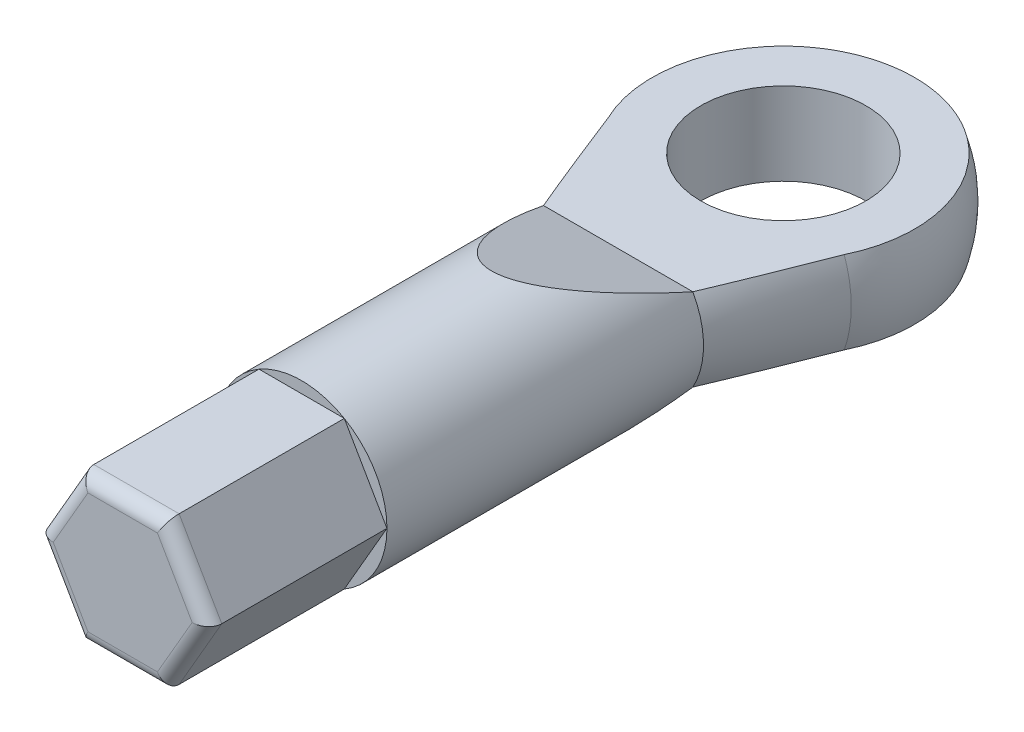
ISO-10303-21;
HEADER;
FILE_DESCRIPTION(('STEP AP214'),'2;1');
FILE_NAME('part.step','',(''),(''),'','','');
FILE_SCHEMA(('AUTOMOTIVE_DESIGN { 1 0 10303 214 1 1 1 1 }'));
ENDSEC;
DATA;
#1=APPLICATION_CONTEXT('core data for automotive mechanical design processes');
#2=APPLICATION_PROTOCOL_DEFINITION('international standard','automotive_design',2000,#1);
#3=PRODUCT_CONTEXT('',#1,'mechanical');
#4=PRODUCT('Part','Part','',(#3));
#5=PRODUCT_RELATED_PRODUCT_CATEGORY('part','',(#4));
#6=PRODUCT_DEFINITION_FORMATION('','',#4);
#7=PRODUCT_DEFINITION_CONTEXT('part definition',#1,'design');
#8=PRODUCT_DEFINITION('design','',#6,#7);
#9=PRODUCT_DEFINITION_SHAPE('','',#8);
#10=(LENGTH_UNIT() NAMED_UNIT(*) SI_UNIT(.MILLI.,.METRE.));
#11=(NAMED_UNIT(*) PLANE_ANGLE_UNIT() SI_UNIT($,.RADIAN.));
#12=(NAMED_UNIT(*) SI_UNIT($,.STERADIAN.) SOLID_ANGLE_UNIT());
#13=UNCERTAINTY_MEASURE_WITH_UNIT(LENGTH_MEASURE(1.E-05),#10,'distance_accuracy_value','');
#14=(GEOMETRIC_REPRESENTATION_CONTEXT(3) GLOBAL_UNCERTAINTY_ASSIGNED_CONTEXT((#13)) GLOBAL_UNIT_ASSIGNED_CONTEXT((#10,
#11,#12)) REPRESENTATION_CONTEXT('',''));
#15=CARTESIAN_POINT('',(0.,0.,0.));
#16=DIRECTION('',(0.,0.,1.));
#17=DIRECTION('',(1.,0.,0.));
#18=AXIS2_PLACEMENT_3D('',#15,#16,#17);
#19=CARTESIAN_POINT('',(0.,0.,-29.));
#20=DIRECTION('',(0.,0.,-1.));
#21=DIRECTION('',(-1.,0.,0.));
#22=AXIS2_PLACEMENT_3D('',#19,#20,#21);
#23=CYLINDRICAL_SURFACE('',#22,3.1);
#24=CARTESIAN_POINT('',(0.,0.,-22.3122593853305));
#25=DIRECTION('',(0.,0.944491108816165,-0.328536977168796));
#26=DIRECTION('',(0.,-0.328536977168796,-0.944491108816166));
#27=AXIS2_PLACEMENT_3D('',#24,#25,#26);
#28=ELLIPSE('',#27,9.43577196915427,3.1);
#29=CARTESIAN_POINT('',(-2.71293199325011,1.5,-18.));
#30=VERTEX_POINT('',#29);
#31=CARTESIAN_POINT('',(2.71293199325011,1.5,-18.));
#32=VERTEX_POINT('',#31);
#33=EDGE_CURVE('E268',#30,#32,#28,.T.);
#34=ORIENTED_EDGE('',*,*,#33,.F.);
#35=CARTESIAN_POINT('',(0.,0.,-18.));
#36=DIRECTION('',(0.,0.,-1.));
#37=DIRECTION('',(-1.,0.,0.));
#38=AXIS2_PLACEMENT_3D('',#35,#36,#37);
#39=CIRCLE('',#38,3.1);
#40=CARTESIAN_POINT('',(-2.71293199325011,-1.5,-18.));
#41=VERTEX_POINT('',#40);
#42=EDGE_CURVE('E272',#41,#30,#39,.T.);
#43=ORIENTED_EDGE('',*,*,#42,.F.);
#44=CARTESIAN_POINT('',(0.,0.,-22.3122593853305));
#45=DIRECTION('',(0.,0.944491108816165,0.328536977168796));
#46=DIRECTION('',(0.,0.328536977168796,-0.944491108816166));
#47=AXIS2_PLACEMENT_3D('',#44,#45,#46);
#48=ELLIPSE('',#47,9.43577196915426,3.1);
#49=CARTESIAN_POINT('',(2.71293199325011,-1.5,-18.));
#50=VERTEX_POINT('',#49);
#51=EDGE_CURVE('E278',#41,#50,#48,.T.);
#52=ORIENTED_EDGE('',*,*,#51,.T.);
#53=EDGE_CURVE('E273',#32,#50,#39,.T.);
#54=ORIENTED_EDGE('',*,*,#53,.F.);
#55=EDGE_LOOP('',(#34,#43,#52,#54));
#56=FACE_BOUND('',#55,.T.);
#57=CARTESIAN_POINT('',(0.,0.,-6.5));
#58=DIRECTION('',(0.,0.,1.));
#59=DIRECTION('',(1.,0.,0.));
#60=AXIS2_PLACEMENT_3D('',#57,#58,#59);
#61=CIRCLE('',#60,3.1);
#62=CARTESIAN_POINT('',(1.55,2.68467875173176,-6.5));
#63=VERTEX_POINT('',#62);
#64=CARTESIAN_POINT('',(-1.55,2.68467875173176,-6.5));
#65=VERTEX_POINT('',#64);
#66=EDGE_CURVE('E168',#63,#65,#61,.T.);
#67=ORIENTED_EDGE('',*,*,#66,.F.);
#68=CARTESIAN_POINT('',(3.1,0.,-6.5));
#69=VERTEX_POINT('',#68);
#70=EDGE_CURVE('E159',#69,#63,#61,.T.);
#71=ORIENTED_EDGE('',*,*,#70,.F.);
#72=CARTESIAN_POINT('',(1.55,-2.68467875173176,-6.5));
#73=VERTEX_POINT('',#72);
#74=EDGE_CURVE('E169',#73,#69,#61,.T.);
#75=ORIENTED_EDGE('',*,*,#74,.F.);
#76=CARTESIAN_POINT('',(-1.55,-2.68467875173176,-6.5));
#77=VERTEX_POINT('',#76);
#78=EDGE_CURVE('E210',#77,#73,#61,.T.);
#79=ORIENTED_EDGE('',*,*,#78,.F.);
#80=CARTESIAN_POINT('',(-3.1,0.,-6.5));
#81=VERTEX_POINT('',#80);
#82=EDGE_CURVE('E204',#81,#77,#61,.T.);
#83=ORIENTED_EDGE('',*,*,#82,.F.);
#84=EDGE_CURVE('E196',#65,#81,#61,.T.);
#85=ORIENTED_EDGE('',*,*,#84,.F.);
#86=EDGE_LOOP('',(#67,#71,#75,#79,#83,#85));
#87=FACE_BOUND('',#86,.T.);
#88=ADVANCED_FACE('F60',(#56,#87),#23,.T.);
#89=CARTESIAN_POINT('',(0.,0.,-24.));
#90=DIRECTION('',(0.,0.,-1.));
#91=DIRECTION('',(1.,0.,0.));
#92=AXIS2_PLACEMENT_3D('',#89,#90,#91);
#93=SPHERICAL_SURFACE('',#92,5.);
#94=CARTESIAN_POINT('',(0.,0.,-21.9195474114293));
#95=DIRECTION('',(0.,0.,-1.));
#96=DIRECTION('',(-1.,0.,0.));
#97=AXIS2_PLACEMENT_3D('',#94,#95,#96);
#98=CIRCLE('',#97,4.54661599727858);
#99=CARTESIAN_POINT('',(-4.29205277538726,-1.5,-21.9195474114293));
#100=VERTEX_POINT('',#99);
#101=CARTESIAN_POINT('',(-4.29205277538726,1.5,-21.9195474114293));
#102=VERTEX_POINT('',#101);
#103=EDGE_CURVE('E296',#100,#102,#98,.T.);
#104=ORIENTED_EDGE('',*,*,#103,.T.);
#105=CARTESIAN_POINT('',(0.,1.5,-24.));
#106=DIRECTION('',(0.,1.,0.));
#107=DIRECTION('',(0.,0.,1.));
#108=AXIS2_PLACEMENT_3D('',#105,#106,#107);
#109=CIRCLE('',#108,4.76969600708473);
#110=CARTESIAN_POINT('',(4.29205277538726,1.5,-21.9195474114293));
#111=VERTEX_POINT('',#110);
#112=EDGE_CURVE('E282',#102,#111,#109,.F.);
#113=ORIENTED_EDGE('',*,*,#112,.T.);
#114=CARTESIAN_POINT('',(4.29205277538726,-1.5,-21.9195474114293));
#115=VERTEX_POINT('',#114);
#116=EDGE_CURVE('E302',#111,#115,#98,.T.);
#117=ORIENTED_EDGE('',*,*,#116,.T.);
#118=CARTESIAN_POINT('',(0.,-1.5,-24.));
#119=DIRECTION('',(0.,1.,0.));
#120=DIRECTION('',(0.,0.,1.));
#121=AXIS2_PLACEMENT_3D('',#118,#119,#120);
#122=CIRCLE('',#121,4.76969600708473);
#123=EDGE_CURVE('E287',#100,#115,#122,.F.);
#124=ORIENTED_EDGE('',*,*,#123,.F.);
#125=EDGE_LOOP('',(#104,#113,#117,#124));
#126=FACE_BOUND('',#125,.T.);
#127=ADVANCED_FACE('F259',(#126),#93,.T.);
#128=CARTESIAN_POINT('',(0.,0.,-21.9195474114293));
#129=DIRECTION('',(0.,0.,-1.));
#130=DIRECTION('',(-1.,0.,0.));
#131=AXIS2_PLACEMENT_3D('',#128,#129,#130);
#132=CONICAL_SURFACE('',#131,4.54661599727858,0.353568087403348);
#133=ORIENTED_EDGE('',*,*,#116,.F.);
#134=CARTESIAN_POINT('',(4.29232645162856,1.5,-21.9202474114293));
#135=CARTESIAN_POINT('',(4.18957206866749,1.5,-21.6574576082276));
#136=CARTESIAN_POINT('',(4.0864903784039,1.5,-21.3947949416636));
#137=CARTESIAN_POINT('',(3.87945014055486,1.5,-20.8698038978936));
#138=CARTESIAN_POINT('',(3.7754915594231,1.5,-20.6074755339227));
#139=CARTESIAN_POINT('',(3.56630151315008,1.5,-20.082797724497));
#140=CARTESIAN_POINT('',(3.46106814958346,1.5,-19.8204490349741));
#141=CARTESIAN_POINT('',(3.24917847020733,1.5,-19.29633427349));
#142=CARTESIAN_POINT('',(3.14252219196407,1.5,-19.0345681863596));
#143=CARTESIAN_POINT('',(2.92796766526275,1.5,-18.5134147146386));
#144=CARTESIAN_POINT('',(2.82008100154595,1.5,-18.2540225731648));
#145=CARTESIAN_POINT('',(2.60170574066845,1.5,-17.73631050032));
#146=CARTESIAN_POINT('',(2.49121694444213,1.5,-17.4779906527703));
#147=CARTESIAN_POINT('',(2.26661550362988,1.5,-16.9631897763164));
#148=CARTESIAN_POINT('',(2.15250615837295,1.5,-16.7067073203243));
#149=CARTESIAN_POINT('',(1.9770240939372,1.5,-16.323979687416));
#150=CARTESIAN_POINT('',(1.9178142148342,1.5,-16.1967443362958));
#151=CARTESIAN_POINT('',(1.79752562200976,1.5,-15.9431625223513));
#152=CARTESIAN_POINT('',(1.73644697587725,1.5,-15.8168160275819));
#153=CARTESIAN_POINT('',(1.61692661885159,1.5,-15.5756285628531));
#154=CARTESIAN_POINT('',(1.55867821985646,1.5,-15.4606922561348));
#155=CARTESIAN_POINT('',(1.43937871262361,1.5,-15.2321999434974));
#156=CARTESIAN_POINT('',(1.37832611759092,1.5,-15.1186447111411));
#157=CARTESIAN_POINT('',(1.25173490864598,1.5,-14.8924720632474));
#158=CARTESIAN_POINT('',(1.18615620622339,1.5,-14.7798767214971));
#159=CARTESIAN_POINT('',(1.08349441668244,1.5,-14.6137022159214));
#160=CARTESIAN_POINT('',(1.04857560864458,1.5,-14.558788958808));
#161=CARTESIAN_POINT('',(0.976930042599293,1.5,-14.4501593401583));
#162=CARTESIAN_POINT('',(0.940203576786867,1.5,-14.3964427872091));
#163=CARTESIAN_POINT('',(0.863807641177478,1.5,-14.2897412967682));
#164=CARTESIAN_POINT('',(0.824098697873053,1.5,-14.2367844060767));
#165=CARTESIAN_POINT('',(0.741594142060845,1.5,-14.13335293842));
#166=CARTESIAN_POINT('',(0.698800741969414,1.5,-14.0828766250461));
#167=CARTESIAN_POINT('',(0.609645549356649,1.5,-13.9863296256307));
#168=CARTESIAN_POINT('',(0.563336840426886,1.5,-13.9402105532173));
#169=CARTESIAN_POINT('',(0.465391588878546,1.5,-13.8541358902414));
#170=CARTESIAN_POINT('',(0.413778904306131,1.5,-13.8141545567037));
#171=CARTESIAN_POINT('',(0.326862464358554,1.5,-13.7593962856672));
#172=CARTESIAN_POINT('',(0.293818373020588,1.5,-13.7410877394808));
#173=CARTESIAN_POINT('',(0.225381075752548,1.5,-13.709474463639));
#174=CARTESIAN_POINT('',(0.189990626084351,1.5,-13.6961639811415));
#175=CARTESIAN_POINT('',(0.122693943999858,1.5,-13.6775848646237));
#176=CARTESIAN_POINT('',(0.091039948143784,1.5,-13.6714219054594));
#177=CARTESIAN_POINT('',(0.0271394385063488,1.5,-13.6646122325375));
#178=CARTESIAN_POINT('',(-0.00510672190267502,1.5,-13.6639623296304));
#179=CARTESIAN_POINT('',(-0.0691800131942437,1.5,-13.6682590233086));
#180=CARTESIAN_POINT('',(-0.101007513413681,1.5,-13.6732002981595));
#181=CARTESIAN_POINT('',(-0.16347050044767,1.5,-13.6880554194986));
#182=CARTESIAN_POINT('',(-0.194104780701845,1.5,-13.697974165296));
#183=CARTESIAN_POINT('',(-0.269890777595555,1.5,-13.7282868734545));
#184=CARTESIAN_POINT('',(-0.313921637141827,1.5,-13.7514447772465));
#185=CARTESIAN_POINT('',(-0.398039124089274,1.5,-13.8040484352998));
#186=CARTESIAN_POINT('',(-0.43811233081007,1.5,-13.8335145789145));
#187=CARTESIAN_POINT('',(-0.529249861777994,1.5,-13.9082655144344));
#188=CARTESIAN_POINT('',(-0.578817481238657,1.5,-13.9553441850621));
#189=CARTESIAN_POINT('',(-0.673329607156852,1.5,-14.053989515449));
#190=CARTESIAN_POINT('',(-0.718263191306242,1.5,-14.1055662722511));
#191=CARTESIAN_POINT('',(-0.80494315362729,1.5,-14.2118811144179));
#192=CARTESIAN_POINT('',(-0.846666085241291,1.5,-14.266638114399));
#193=CARTESIAN_POINT('',(-0.927403368799787,1.5,-14.3779947256855));
#194=CARTESIAN_POINT('',(-0.966420797561668,1.5,-14.4345921326613));
#195=CARTESIAN_POINT('',(-1.04658568301603,1.5,-14.5554414838451));
#196=CARTESIAN_POINT('',(-1.08749512939635,1.5,-14.6198504479884));
#197=CARTESIAN_POINT('',(-1.16736033707001,1.5,-14.7498727131415));
#198=CARTESIAN_POINT('',(-1.20631581263416,1.5,-14.8154861883819));
#199=CARTESIAN_POINT('',(-1.32091856598163,1.5,-15.0137246805795));
#200=CARTESIAN_POINT('',(-1.39425894570499,1.5,-15.1476804187233));
#201=CARTESIAN_POINT('',(-1.53701369489963,1.5,-15.4180235589124));
#202=CARTESIAN_POINT('',(-1.60641878243738,1.5,-15.5544157871374));
#203=CARTESIAN_POINT('',(-1.74228346016152,1.5,-15.8286022131632));
#204=CARTESIAN_POINT('',(-1.80874395554087,1.5,-15.9663959638818));
#205=CARTESIAN_POINT('',(-1.93944712428028,1.5,-16.24288269126));
#206=CARTESIAN_POINT('',(-2.00369164081409,1.5,-16.381574800766));
#207=CARTESIAN_POINT('',(-2.13052772805926,1.5,-16.6597235163791));
#208=CARTESIAN_POINT('',(-2.19311917396962,1.5,-16.7991801792529));
#209=CARTESIAN_POINT('',(-2.3788035130327,1.5,-17.2180525272028));
#210=CARTESIAN_POINT('',(-2.49996961759906,1.5,-17.4983211617543));
#211=CARTESIAN_POINT('',(-2.76553476188813,1.5,-18.1227504438519));
#212=CARTESIAN_POINT('',(-2.90910858560611,1.5,-18.4672598154922));
#213=CARTESIAN_POINT('',(-3.19308125720649,1.5,-19.1577625763544));
#214=CARTESIAN_POINT('',(-3.33347863777454,1.5,-19.5037565669935));
#215=CARTESIAN_POINT('',(-3.61121263032934,1.5,-20.1945681919729));
#216=CARTESIAN_POINT('',(-3.74856251838732,1.5,-20.5393805022989));
#217=CARTESIAN_POINT('',(-4.02156030244991,1.5,-21.2294763203855));
#218=CARTESIAN_POINT('',(-4.15720902705487,1.5,-21.5747595000921));
#219=CARTESIAN_POINT('',(-4.29232645162856,1.5,-21.9202474114293));
#220=B_SPLINE_CURVE_WITH_KNOTS('',3,(#134,#135,#136,#137,#138,#139,#140,#141,#142,#143,#144,
#145,#146,#147,#148,#149,#150,#151,#152,#153,#154,#155,#156,#157,#158,#159,#160,#161,#162,#163,
#164,#165,#166,#167,#168,#169,#170,#171,#172,#173,#174,#175,#176,#177,#178,#179,#180,#181,#182,
#183,#184,#185,#186,#187,#188,#189,#190,#191,#192,#193,#194,#195,#196,#197,#198,#199,#200,#201,
#202,#203,#204,#205,#206,#207,#208,#209,#210,#211,#212,#213,#214,#215,#216,#217,#218,#219),
.UNSPECIFIED.,.F.,.F.,(4,2,2,2,2,2,2,2,2,2,2,2,2,2,2,2,2,2,2,2,2,2,2,2,2,2,2,2,2,2,2,2,2,2,2,2,
2,2,2,2,2,2,4),(0.,0.846495193030042,1.69302291779209,2.54102207010385,3.38899887859642,
4.2317896857966,5.07464517808347,5.91675348863317,6.33775527881788,6.75874186031189,
7.14527335564698,7.53201221204425,7.92277764639982,8.1179770447829,8.3131449935372,
8.51163729752142,8.70998861740989,8.90578417388262,9.10073466018817,9.21377036970642,
9.32667557178058,9.42298918776154,9.5192470851951,9.61541344048745,9.71167463823025,
9.86005816006294,10.008928726774,10.2134933724447,10.418529652567,10.6249437442969,
10.8311191063476,11.0599802260152,11.2888747150631,11.7469034873614,12.2059711218597,
12.6648966417328,13.1234307572737,13.5819993921362,14.4979767206865,15.6176414738849,
16.7378132955265,17.8512918854636,18.9642052320191),.UNSPECIFIED.);
#221=EDGE_CURVE('E205',#111,#32,#220,.T.);
#222=ORIENTED_EDGE('',*,*,#221,.T.);
#223=ORIENTED_EDGE('',*,*,#53,.T.);
#224=CARTESIAN_POINT('',(4.29232645162856,-1.5,-21.9202474114293));
#225=CARTESIAN_POINT('',(4.18957206866749,-1.5,-21.6574576082276));
#226=CARTESIAN_POINT('',(4.08649037840389,-1.5,-21.3947949416636));
#227=CARTESIAN_POINT('',(3.87945014055486,-1.5,-20.8698038978936));
#228=CARTESIAN_POINT('',(3.77549155942309,-1.5,-20.6074755339227));
#229=CARTESIAN_POINT('',(3.56630151315008,-1.5,-20.082797724497));
#230=CARTESIAN_POINT('',(3.46106814958346,-1.5,-19.8204490349741));
#231=CARTESIAN_POINT('',(3.24917847020733,-1.5,-19.29633427349));
#232=CARTESIAN_POINT('',(3.14252219196406,-1.5,-19.0345681863596));
#233=CARTESIAN_POINT('',(2.92796766526274,-1.5,-18.5134147146386));
#234=CARTESIAN_POINT('',(2.82008100154594,-1.5,-18.2540225731647));
#235=CARTESIAN_POINT('',(2.60170574066844,-1.5,-17.73631050032));
#236=CARTESIAN_POINT('',(2.49121694444212,-1.5,-17.4779906527703));
#237=CARTESIAN_POINT('',(2.26661550362988,-1.5,-16.9631897763164));
#238=CARTESIAN_POINT('',(2.15250615837294,-1.5,-16.7067073203243));
#239=CARTESIAN_POINT('',(1.9770240939372,-1.5,-16.323979687416));
#240=CARTESIAN_POINT('',(1.9178142148342,-1.5,-16.1967443362958));
#241=CARTESIAN_POINT('',(1.79752562200976,-1.5,-15.9431625223513));
#242=CARTESIAN_POINT('',(1.73644697587725,-1.5,-15.8168160275819));
#243=CARTESIAN_POINT('',(1.61692661885159,-1.5,-15.5756285628531));
#244=CARTESIAN_POINT('',(1.55867821985646,-1.5,-15.4606922561348));
#245=CARTESIAN_POINT('',(1.43937871262361,-1.5,-15.2321999434974));
#246=CARTESIAN_POINT('',(1.37832611759092,-1.5,-15.1186447111411));
#247=CARTESIAN_POINT('',(1.25173490864598,-1.5,-14.8924720632474));
#248=CARTESIAN_POINT('',(1.18615620622339,-1.5,-14.7798767214971));
#249=CARTESIAN_POINT('',(1.08349441668243,-1.5,-14.6137022159214));
#250=CARTESIAN_POINT('',(1.04857560864458,-1.5,-14.558788958808));
#251=CARTESIAN_POINT('',(0.976930042599291,-1.5,-14.4501593401583));
#252=CARTESIAN_POINT('',(0.940203576786865,-1.5,-14.3964427872091));
#253=CARTESIAN_POINT('',(0.863807641177477,-1.5,-14.2897412967682));
#254=CARTESIAN_POINT('',(0.824098697873053,-1.5,-14.2367844060767));
#255=CARTESIAN_POINT('',(0.741594142060844,-1.5,-14.13335293842));
#256=CARTESIAN_POINT('',(0.698800741969412,-1.5,-14.0828766250461));
#257=CARTESIAN_POINT('',(0.609645549356647,-1.5,-13.9863296256307));
#258=CARTESIAN_POINT('',(0.563336840426885,-1.5,-13.9402105532173));
#259=CARTESIAN_POINT('',(0.465391588878544,-1.5,-13.8541358902414));
#260=CARTESIAN_POINT('',(0.413778904306129,-1.5,-13.8141545567037));
#261=CARTESIAN_POINT('',(0.326862464358553,-1.5,-13.7593962856672));
#262=CARTESIAN_POINT('',(0.293818373020587,-1.5,-13.7410877394808));
#263=CARTESIAN_POINT('',(0.225381075752548,-1.5,-13.709474463639));
#264=CARTESIAN_POINT('',(0.18999062608435,-1.5,-13.6961639811415));
#265=CARTESIAN_POINT('',(0.122693943999857,-1.5,-13.6775848646237));
#266=CARTESIAN_POINT('',(0.0910399481437826,-1.5,-13.6714219054594));
#267=CARTESIAN_POINT('',(0.0271394385063477,-1.5,-13.6646122325375));
#268=CARTESIAN_POINT('',(-0.00510672190267581,-1.5,-13.6639623296304));
#269=CARTESIAN_POINT('',(-0.0691800131942441,-1.5,-13.6682590233086));
#270=CARTESIAN_POINT('',(-0.101007513413682,-1.5,-13.6732002981595));
#271=CARTESIAN_POINT('',(-0.163470500447671,-1.5,-13.6880554194986));
#272=CARTESIAN_POINT('',(-0.194104780701845,-1.5,-13.697974165296));
#273=CARTESIAN_POINT('',(-0.269890777595555,-1.5,-13.7282868734545));
#274=CARTESIAN_POINT('',(-0.313921637141829,-1.5,-13.7514447772465));
#275=CARTESIAN_POINT('',(-0.398039124089276,-1.5,-13.8040484352998));
#276=CARTESIAN_POINT('',(-0.438112330810071,-1.5,-13.8335145789145));
#277=CARTESIAN_POINT('',(-0.529249861777993,-1.5,-13.9082655144344));
#278=CARTESIAN_POINT('',(-0.578817481238657,-1.5,-13.9553441850621));
#279=CARTESIAN_POINT('',(-0.673329607156852,-1.5,-14.053989515449));
#280=CARTESIAN_POINT('',(-0.718263191306241,-1.5,-14.1055662722512));
#281=CARTESIAN_POINT('',(-0.80494315362729,-1.5,-14.2118811144179));
#282=CARTESIAN_POINT('',(-0.846666085241291,-1.5,-14.266638114399));
#283=CARTESIAN_POINT('',(-0.927403368799787,-1.5,-14.3779947256855));
#284=CARTESIAN_POINT('',(-0.966420797561668,-1.5,-14.4345921326613));
#285=CARTESIAN_POINT('',(-1.04658568301602,-1.5,-14.5554414838451));
#286=CARTESIAN_POINT('',(-1.08749512939635,-1.5,-14.6198504479884));
#287=CARTESIAN_POINT('',(-1.16736033707001,-1.5,-14.7498727131415));
#288=CARTESIAN_POINT('',(-1.20631581263416,-1.5,-14.8154861883819));
#289=CARTESIAN_POINT('',(-1.32091856598163,-1.5,-15.0137246805795));
#290=CARTESIAN_POINT('',(-1.39425894570499,-1.5,-15.1476804187233));
#291=CARTESIAN_POINT('',(-1.53701369489963,-1.5,-15.4180235589124));
#292=CARTESIAN_POINT('',(-1.60641878243738,-1.5,-15.5544157871374));
#293=CARTESIAN_POINT('',(-1.74228346016152,-1.5,-15.8286022131632));
#294=CARTESIAN_POINT('',(-1.80874395554087,-1.5,-15.9663959638818));
#295=CARTESIAN_POINT('',(-1.93944712428028,-1.5,-16.24288269126));
#296=CARTESIAN_POINT('',(-2.00369164081409,-1.5,-16.381574800766));
#297=CARTESIAN_POINT('',(-2.13052772805926,-1.5,-16.6597235163791));
#298=CARTESIAN_POINT('',(-2.19311917396962,-1.5,-16.7991801792529));
#299=CARTESIAN_POINT('',(-2.3788035130327,-1.5,-17.2180525272028));
#300=CARTESIAN_POINT('',(-2.49996961759906,-1.5,-17.4983211617543));
#301=CARTESIAN_POINT('',(-2.76553476188813,-1.5,-18.1227504438519));
#302=CARTESIAN_POINT('',(-2.9091085856061,-1.5,-18.4672598154922));
#303=CARTESIAN_POINT('',(-3.19308125720648,-1.5,-19.1577625763544));
#304=CARTESIAN_POINT('',(-3.33347863777453,-1.5,-19.5037565669934));
#305=CARTESIAN_POINT('',(-3.61121263032934,-1.5,-20.1945681919729));
#306=CARTESIAN_POINT('',(-3.74856251838732,-1.5,-20.5393805022989));
#307=CARTESIAN_POINT('',(-4.02156030244991,-1.5,-21.2294763203855));
#308=CARTESIAN_POINT('',(-4.15720902705487,-1.5,-21.5747595000921));
#309=CARTESIAN_POINT('',(-4.29232645162856,-1.5,-21.9202474114293));
#310=B_SPLINE_CURVE_WITH_KNOTS('',3,(#224,#225,#226,#227,#228,#229,#230,#231,#232,#233,#234,
#235,#236,#237,#238,#239,#240,#241,#242,#243,#244,#245,#246,#247,#248,#249,#250,#251,#252,#253,
#254,#255,#256,#257,#258,#259,#260,#261,#262,#263,#264,#265,#266,#267,#268,#269,#270,#271,#272,
#273,#274,#275,#276,#277,#278,#279,#280,#281,#282,#283,#284,#285,#286,#287,#288,#289,#290,#291,
#292,#293,#294,#295,#296,#297,#298,#299,#300,#301,#302,#303,#304,#305,#306,#307,#308,#309),
.UNSPECIFIED.,.F.,.F.,(4,2,2,2,2,2,2,2,2,2,2,2,2,2,2,2,2,2,2,2,2,2,2,2,2,2,2,2,2,2,2,2,2,2,2,2,
2,2,2,2,2,2,4),(0.,0.846495193030049,1.69302291779209,2.54102207010386,3.38899887859644,
4.23178968579661,5.07464517808348,5.91675348863317,6.33775527881788,6.75874186031189,
7.14527335564698,7.53201221204426,7.92277764639983,8.1179770447829,8.3131449935372,
8.51163729752142,8.70998861740989,8.90578417388262,9.10073466018817,9.21377036970642,
9.32667557178058,9.42298918776154,9.51924708519509,9.61541344048744,9.71167463823024,
9.86005816006294,10.008928726774,10.2134933724447,10.418529652567,10.6249437442969,
10.8311191063476,11.0599802260152,11.2888747150631,11.7469034873614,12.2059711218597,
12.6648966417328,13.1234307572737,13.5819993921361,14.4979767206865,15.6176414738848,
16.7378132955264,17.8512918854636,18.9642052320191),.UNSPECIFIED.);
#311=EDGE_CURVE('E219',#115,#50,#310,.T.);
#312=ORIENTED_EDGE('',*,*,#311,.F.);
#313=EDGE_LOOP('',(#133,#222,#223,#312));
#314=FACE_BOUND('',#313,.T.);
#315=ADVANCED_FACE('F234',(#314),#132,.T.);
#316=ORIENTED_EDGE('',*,*,#42,.T.);
#317=EDGE_CURVE('E212',#30,#102,#220,.T.);
#318=ORIENTED_EDGE('',*,*,#317,.T.);
#319=ORIENTED_EDGE('',*,*,#103,.F.);
#320=EDGE_CURVE('E227',#41,#100,#310,.T.);
#321=ORIENTED_EDGE('',*,*,#320,.F.);
#322=EDGE_LOOP('',(#316,#318,#319,#321));
#323=FACE_BOUND('',#322,.T.);
#324=ADVANCED_FACE('F249',(#323),#132,.T.);
#325=CARTESIAN_POINT('',(-6.,-6.923499751308,-2.40830819738968));
#326=DIRECTION('',(0.,0.944491108816165,0.328536977168796));
#327=DIRECTION('',(0.,-0.328536977168796,0.944491108816166));
#328=AXIS2_PLACEMENT_3D('',#325,#326,#327);
#329=PLANE('',#328);
#330=DIRECTION('',(1.,0.,0.));
#331=VECTOR('',#330,1.);
#332=CARTESIAN_POINT('',(-6.,-1.5,-18.));
#333=LINE('',#332,#331);
#334=EDGE_CURVE('E288',#41,#50,#333,.T.);
#335=ORIENTED_EDGE('',*,*,#334,.T.);
#336=ORIENTED_EDGE('',*,*,#51,.F.);
#337=EDGE_LOOP('',(#335,#336));
#338=FACE_BOUND('',#337,.T.);
#339=ADVANCED_FACE('F246',(#338),#329,.F.);
#340=CARTESIAN_POINT('',(-6.,-1.5,0.));
#341=DIRECTION('',(0.,1.,0.));
#342=DIRECTION('',(0.,0.,1.));
#343=AXIS2_PLACEMENT_3D('',#340,#341,#342);
#344=PLANE('',#343);
#345=CARTESIAN_POINT('',(0.,-1.5,-24.));
#346=DIRECTION('',(0.,1.,0.));
#347=DIRECTION('',(0.,0.,1.));
#348=AXIS2_PLACEMENT_3D('',#345,#346,#347);
#349=CIRCLE('',#348,3.);
#350=CARTESIAN_POINT('',(0.,-1.5,-21.));
#351=VERTEX_POINT('',#350);
#352=EDGE_CURVE('E347',#351,#351,#349,.T.);
#353=ORIENTED_EDGE('',*,*,#352,.T.);
#354=EDGE_LOOP('',(#353));
#355=FACE_BOUND('',#354,.T.);
#356=ORIENTED_EDGE('',*,*,#311,.T.);
#357=ORIENTED_EDGE('',*,*,#334,.F.);
#358=ORIENTED_EDGE('',*,*,#320,.T.);
#359=ORIENTED_EDGE('',*,*,#123,.T.);
#360=EDGE_LOOP('',(#356,#357,#358,#359));
#361=FACE_BOUND('',#360,.T.);
#362=ADVANCED_FACE('F248',(#355,#361),#344,.F.);
#363=CARTESIAN_POINT('',(-6.,6.923499751308,-2.40830819738968));
#364=DIRECTION('',(0.,0.944491108816165,-0.328536977168796));
#365=DIRECTION('',(0.,0.328536977168796,0.944491108816166));
#366=AXIS2_PLACEMENT_3D('',#363,#364,#365);
#367=PLANE('',#366);
#368=DIRECTION('',(1.,0.,0.));
#369=VECTOR('',#368,1.);
#370=CARTESIAN_POINT('',(-6.,1.5,-18.));
#371=LINE('',#370,#369);
#372=EDGE_CURVE('E280',#30,#32,#371,.T.);
#373=ORIENTED_EDGE('',*,*,#372,.F.);
#374=ORIENTED_EDGE('',*,*,#33,.T.);
#375=EDGE_LOOP('',(#373,#374));
#376=FACE_BOUND('',#375,.T.);
#377=ADVANCED_FACE('F243',(#376),#367,.T.);
#378=CARTESIAN_POINT('',(-6.,1.5,0.));
#379=DIRECTION('',(0.,1.,0.));
#380=DIRECTION('',(0.,0.,1.));
#381=AXIS2_PLACEMENT_3D('',#378,#379,#380);
#382=PLANE('',#381);
#383=CARTESIAN_POINT('',(0.,1.5,-24.));
#384=DIRECTION('',(0.,1.,0.));
#385=DIRECTION('',(0.,0.,1.));
#386=AXIS2_PLACEMENT_3D('',#383,#384,#385);
#387=CIRCLE('',#386,3.);
#388=CARTESIAN_POINT('',(0.,1.5,-21.));
#389=VERTEX_POINT('',#388);
#390=EDGE_CURVE('E343',#389,#389,#387,.T.);
#391=ORIENTED_EDGE('',*,*,#390,.F.);
#392=EDGE_LOOP('',(#391));
#393=FACE_BOUND('',#392,.T.);
#394=ORIENTED_EDGE('',*,*,#112,.F.);
#395=ORIENTED_EDGE('',*,*,#317,.F.);
#396=ORIENTED_EDGE('',*,*,#372,.T.);
#397=ORIENTED_EDGE('',*,*,#221,.F.);
#398=EDGE_LOOP('',(#394,#395,#396,#397));
#399=FACE_BOUND('',#398,.T.);
#400=ADVANCED_FACE('F238',(#393,#399),#382,.T.);
#401=CARTESIAN_POINT('',(0.,0.,-6.5));
#402=DIRECTION('',(0.,0.,1.));
#403=DIRECTION('',(1.,0.,0.));
#404=AXIS2_PLACEMENT_3D('',#401,#402,#403);
#405=PLANE('',#404);
#406=ORIENTED_EDGE('',*,*,#70,.T.);
#407=DIRECTION('',(-0.5,0.866025403784439,0.));
#408=VECTOR('',#407,1.);
#409=CARTESIAN_POINT('',(3.1,0.,-6.5));
#410=LINE('',#409,#408);
#411=EDGE_CURVE('E162',#69,#63,#410,.T.);
#412=ORIENTED_EDGE('',*,*,#411,.F.);
#413=EDGE_LOOP('',(#406,#412));
#414=FACE_BOUND('',#413,.T.);
#415=ADVANCED_FACE('F160',(#414),#405,.T.);
#416=ORIENTED_EDGE('',*,*,#66,.T.);
#417=DIRECTION('',(-1.,0.,0.));
#418=VECTOR('',#417,1.);
#419=CARTESIAN_POINT('',(1.55,2.68467875173176,-6.5));
#420=LINE('',#419,#418);
#421=EDGE_CURVE('E175',#63,#65,#420,.T.);
#422=ORIENTED_EDGE('',*,*,#421,.F.);
#423=EDGE_LOOP('',(#416,#422));
#424=FACE_BOUND('',#423,.T.);
#425=ADVANCED_FACE('F184',(#424),#405,.T.);
#426=ORIENTED_EDGE('',*,*,#84,.T.);
#427=DIRECTION('',(-0.5,-0.866025403784439,0.));
#428=VECTOR('',#427,1.);
#429=CARTESIAN_POINT('',(-1.55,2.68467875173176,-6.5));
#430=LINE('',#429,#428);
#431=EDGE_CURVE('E187',#65,#81,#430,.T.);
#432=ORIENTED_EDGE('',*,*,#431,.F.);
#433=EDGE_LOOP('',(#426,#432));
#434=FACE_BOUND('',#433,.T.);
#435=ADVANCED_FACE('F455',(#434),#405,.T.);
#436=ORIENTED_EDGE('',*,*,#82,.T.);
#437=DIRECTION('',(0.5,-0.866025403784438,0.));
#438=VECTOR('',#437,1.);
#439=CARTESIAN_POINT('',(-3.1,0.,-6.5));
#440=LINE('',#439,#438);
#441=EDGE_CURVE('E336',#81,#77,#440,.T.);
#442=ORIENTED_EDGE('',*,*,#441,.F.);
#443=EDGE_LOOP('',(#436,#442));
#444=FACE_BOUND('',#443,.T.);
#445=ADVANCED_FACE('F451',(#444),#405,.T.);
#446=ORIENTED_EDGE('',*,*,#78,.T.);
#447=DIRECTION('',(1.,0.,0.));
#448=VECTOR('',#447,1.);
#449=CARTESIAN_POINT('',(-1.55,-2.68467875173176,-6.5));
#450=LINE('',#449,#448);
#451=EDGE_CURVE('E333',#77,#73,#450,.T.);
#452=ORIENTED_EDGE('',*,*,#451,.F.);
#453=EDGE_LOOP('',(#446,#452));
#454=FACE_BOUND('',#453,.T.);
#455=ADVANCED_FACE('F445',(#454),#405,.T.);
#456=ORIENTED_EDGE('',*,*,#74,.T.);
#457=DIRECTION('',(0.5,0.866025403784439,0.));
#458=VECTOR('',#457,1.);
#459=CARTESIAN_POINT('',(1.55,-2.68467875173176,-6.5));
#460=LINE('',#459,#458);
#461=EDGE_CURVE('E181',#73,#69,#460,.T.);
#462=ORIENTED_EDGE('',*,*,#461,.F.);
#463=EDGE_LOOP('',(#456,#462));
#464=FACE_BOUND('',#463,.T.);
#465=ADVANCED_FACE('F443',(#464),#405,.T.);
#466=CARTESIAN_POINT('',(3.1,0.,-6.5));
#467=DIRECTION('',(0.866025403784439,0.5,0.));
#468=DIRECTION('',(-0.5,0.866025403784439,0.));
#469=AXIS2_PLACEMENT_3D('',#466,#467,#468);
#470=PLANE('',#469);
#471=DIRECTION('',(0.,0.,1.));
#472=VECTOR('',#471,1.);
#473=CARTESIAN_POINT('',(1.55,2.68467875173176,-6.5));
#474=LINE('',#473,#472);
#475=CARTESIAN_POINT('',(1.55,2.68467875173176,-0.500000000000001));
#476=VERTEX_POINT('',#475);
#477=EDGE_CURVE('E172',#63,#476,#474,.T.);
#478=ORIENTED_EDGE('',*,*,#477,.T.);
#479=DIRECTION('',(-0.5,0.866025403784439,0.));
#480=VECTOR('',#479,1.);
#481=CARTESIAN_POINT('',(3.1,0.,-0.5));
#482=LINE('',#481,#480);
#483=CARTESIAN_POINT('',(3.1,0.,-0.500000000000001));
#484=VERTEX_POINT('',#483);
#485=EDGE_CURVE('E15',#476,#484,#482,.F.);
#486=ORIENTED_EDGE('',*,*,#485,.T.);
#487=DIRECTION('',(0.,0.,1.));
#488=VECTOR('',#487,1.);
#489=CARTESIAN_POINT('',(3.1,0.,-6.5));
#490=LINE('',#489,#488);
#491=EDGE_CURVE('E192',#69,#484,#490,.T.);
#492=ORIENTED_EDGE('',*,*,#491,.F.);
#493=ORIENTED_EDGE('',*,*,#411,.T.);
#494=EDGE_LOOP('',(#478,#486,#492,#493));
#495=FACE_BOUND('',#494,.T.);
#496=ADVANCED_FACE('F190',(#495),#470,.T.);
#497=CARTESIAN_POINT('',(1.55,-2.68467875173176,-6.5));
#498=DIRECTION('',(0.866025403784439,-0.5,0.));
#499=DIRECTION('',(0.5,0.866025403784439,0.));
#500=AXIS2_PLACEMENT_3D('',#497,#498,#499);
#501=PLANE('',#500);
#502=ORIENTED_EDGE('',*,*,#491,.T.);
#503=DIRECTION('',(0.5,0.866025403784439,0.));
#504=VECTOR('',#503,1.);
#505=CARTESIAN_POINT('',(1.55,-2.68467875173176,-0.5));
#506=LINE('',#505,#504);
#507=CARTESIAN_POINT('',(1.55,-2.68467875173176,-0.500000000000001));
#508=VERTEX_POINT('',#507);
#509=EDGE_CURVE('E399',#484,#508,#506,.F.);
#510=ORIENTED_EDGE('',*,*,#509,.T.);
#511=DIRECTION('',(0.,0.,1.));
#512=VECTOR('',#511,1.);
#513=CARTESIAN_POINT('',(1.55,-2.68467875173176,-6.5));
#514=LINE('',#513,#512);
#515=EDGE_CURVE('E315',#73,#508,#514,.T.);
#516=ORIENTED_EDGE('',*,*,#515,.F.);
#517=ORIENTED_EDGE('',*,*,#461,.T.);
#518=EDGE_LOOP('',(#502,#510,#516,#517));
#519=FACE_BOUND('',#518,.T.);
#520=ADVANCED_FACE('F420',(#519),#501,.T.);
#521=CARTESIAN_POINT('',(-1.55,-2.68467875173176,-6.5));
#522=DIRECTION('',(0.,-1.,0.));
#523=DIRECTION('',(1.,0.,0.));
#524=AXIS2_PLACEMENT_3D('',#521,#522,#523);
#525=PLANE('',#524);
#526=ORIENTED_EDGE('',*,*,#515,.T.);
#527=DIRECTION('',(1.,0.,0.));
#528=VECTOR('',#527,1.);
#529=CARTESIAN_POINT('',(-1.55,-2.68467875173176,-0.5));
#530=LINE('',#529,#528);
#531=CARTESIAN_POINT('',(-1.55,-2.68467875173176,-0.500000000000001));
#532=VERTEX_POINT('',#531);
#533=EDGE_CURVE('E394',#508,#532,#530,.F.);
#534=ORIENTED_EDGE('',*,*,#533,.T.);
#535=DIRECTION('',(0.,0.,1.));
#536=VECTOR('',#535,1.);
#537=CARTESIAN_POINT('',(-1.55,-2.68467875173176,-6.5));
#538=LINE('',#537,#536);
#539=EDGE_CURVE('E324',#77,#532,#538,.T.);
#540=ORIENTED_EDGE('',*,*,#539,.F.);
#541=ORIENTED_EDGE('',*,*,#451,.T.);
#542=EDGE_LOOP('',(#526,#534,#540,#541));
#543=FACE_BOUND('',#542,.T.);
#544=ADVANCED_FACE('F431',(#543),#525,.T.);
#545=CARTESIAN_POINT('',(-3.1,0.,-6.5));
#546=DIRECTION('',(-0.866025403784438,-0.5,0.));
#547=DIRECTION('',(0.5,-0.866025403784439,0.));
#548=AXIS2_PLACEMENT_3D('',#545,#546,#547);
#549=PLANE('',#548);
#550=ORIENTED_EDGE('',*,*,#539,.T.);
#551=DIRECTION('',(0.5,-0.866025403784439,0.));
#552=VECTOR('',#551,1.);
#553=CARTESIAN_POINT('',(-3.1,0.,-0.5));
#554=LINE('',#553,#552);
#555=CARTESIAN_POINT('',(-3.1,0.,-0.500000000000001));
#556=VERTEX_POINT('',#555);
#557=EDGE_CURVE('E385',#532,#556,#554,.F.);
#558=ORIENTED_EDGE('',*,*,#557,.T.);
#559=DIRECTION('',(0.,0.,1.));
#560=VECTOR('',#559,1.);
#561=CARTESIAN_POINT('',(-3.1,0.,-6.5));
#562=LINE('',#561,#560);
#563=EDGE_CURVE('E321',#81,#556,#562,.T.);
#564=ORIENTED_EDGE('',*,*,#563,.F.);
#565=ORIENTED_EDGE('',*,*,#441,.T.);
#566=EDGE_LOOP('',(#550,#558,#564,#565));
#567=FACE_BOUND('',#566,.T.);
#568=ADVANCED_FACE('F434',(#567),#549,.T.);
#569=CARTESIAN_POINT('',(-1.55,2.68467875173176,-6.5));
#570=DIRECTION('',(-0.866025403784439,0.5,0.));
#571=DIRECTION('',(-0.5,-0.866025403784439,0.));
#572=AXIS2_PLACEMENT_3D('',#569,#570,#571);
#573=PLANE('',#572);
#574=ORIENTED_EDGE('',*,*,#563,.T.);
#575=DIRECTION('',(-0.5,-0.866025403784439,0.));
#576=VECTOR('',#575,1.);
#577=CARTESIAN_POINT('',(-1.55,2.68467875173176,-0.5));
#578=LINE('',#577,#576);
#579=CARTESIAN_POINT('',(-1.55,2.68467875173176,-0.500000000000001));
#580=VERTEX_POINT('',#579);
#581=EDGE_CURVE('E85',#556,#580,#578,.F.);
#582=ORIENTED_EDGE('',*,*,#581,.T.);
#583=DIRECTION('',(0.,0.,1.));
#584=VECTOR('',#583,1.);
#585=CARTESIAN_POINT('',(-1.55,2.68467875173176,-6.5));
#586=LINE('',#585,#584);
#587=EDGE_CURVE('E180',#65,#580,#586,.T.);
#588=ORIENTED_EDGE('',*,*,#587,.F.);
#589=ORIENTED_EDGE('',*,*,#431,.T.);
#590=EDGE_LOOP('',(#574,#582,#588,#589));
#591=FACE_BOUND('',#590,.T.);
#592=ADVANCED_FACE('F505',(#591),#573,.T.);
#593=CARTESIAN_POINT('',(1.55,2.68467875173176,-6.5));
#594=DIRECTION('',(0.,1.,0.));
#595=DIRECTION('',(-1.,0.,0.));
#596=AXIS2_PLACEMENT_3D('',#593,#594,#595);
#597=PLANE('',#596);
#598=ORIENTED_EDGE('',*,*,#587,.T.);
#599=DIRECTION('',(-1.,0.,0.));
#600=VECTOR('',#599,1.);
#601=CARTESIAN_POINT('',(1.55,2.68467875173176,-0.5));
#602=LINE('',#601,#600);
#603=EDGE_CURVE('E70',#580,#476,#602,.F.);
#604=ORIENTED_EDGE('',*,*,#603,.T.);
#605=ORIENTED_EDGE('',*,*,#477,.F.);
#606=ORIENTED_EDGE('',*,*,#421,.T.);
#607=EDGE_LOOP('',(#598,#604,#605,#606));
#608=FACE_BOUND('',#607,.T.);
#609=ADVANCED_FACE('F174',(#608),#597,.T.);
#610=CARTESIAN_POINT('',(0.,0.,0.));
#611=DIRECTION('',(0.,0.,-1.));
#612=DIRECTION('',(-1.,0.,0.));
#613=AXIS2_PLACEMENT_3D('',#610,#611,#612);
#614=PLANE('',#613);
#615=DIRECTION('',(1.,0.,0.));
#616=VECTOR('',#615,1.);
#617=CARTESIAN_POINT('',(1.55,-2.18467875173176,0.));
#618=LINE('',#617,#616);
#619=CARTESIAN_POINT('',(-1.26132486540519,-2.18467875173176,0.));
#620=VERTEX_POINT('',#619);
#621=CARTESIAN_POINT('',(1.26132486540519,-2.18467875173176,0.));
#622=VERTEX_POINT('',#621);
#623=EDGE_CURVE('E407',#620,#622,#618,.T.);
#624=ORIENTED_EDGE('',*,*,#623,.T.);
#625=DIRECTION('',(0.5,0.866025403784439,0.));
#626=VECTOR('',#625,1.);
#627=CARTESIAN_POINT('',(2.66698729810778,0.250000000000001,0.));
#628=LINE('',#627,#626);
#629=CARTESIAN_POINT('',(2.52264973081037,0.,0.));
#630=VERTEX_POINT('',#629);
#631=EDGE_CURVE('E403',#622,#630,#628,.T.);
#632=ORIENTED_EDGE('',*,*,#631,.T.);
#633=DIRECTION('',(-0.5,0.866025403784439,0.));
#634=VECTOR('',#633,1.);
#635=CARTESIAN_POINT('',(1.11698729810778,2.43467875173176,0.));
#636=LINE('',#635,#634);
#637=CARTESIAN_POINT('',(1.26132486540519,2.18467875173176,0.));
#638=VERTEX_POINT('',#637);
#639=EDGE_CURVE('E198',#630,#638,#636,.T.);
#640=ORIENTED_EDGE('',*,*,#639,.T.);
#641=DIRECTION('',(-1.,0.,0.));
#642=VECTOR('',#641,1.);
#643=CARTESIAN_POINT('',(-1.55,2.18467875173176,0.));
#644=LINE('',#643,#642);
#645=CARTESIAN_POINT('',(-1.26132486540519,2.18467875173176,0.));
#646=VERTEX_POINT('',#645);
#647=EDGE_CURVE('E200',#638,#646,#644,.T.);
#648=ORIENTED_EDGE('',*,*,#647,.T.);
#649=DIRECTION('',(-0.5,-0.866025403784439,0.));
#650=VECTOR('',#649,1.);
#651=CARTESIAN_POINT('',(-2.66698729810778,-0.250000000000001,0.));
#652=LINE('',#651,#650);
#653=CARTESIAN_POINT('',(-2.52264973081037,0.,0.));
#654=VERTEX_POINT('',#653);
#655=EDGE_CURVE('E389',#646,#654,#652,.T.);
#656=ORIENTED_EDGE('',*,*,#655,.T.);
#657=DIRECTION('',(0.5,-0.866025403784439,0.));
#658=VECTOR('',#657,1.);
#659=CARTESIAN_POINT('',(-1.11698729810778,-2.43467875173176,0.));
#660=LINE('',#659,#658);
#661=EDGE_CURVE('E386',#654,#620,#660,.T.);
#662=ORIENTED_EDGE('',*,*,#661,.T.);
#663=EDGE_LOOP('',(#624,#632,#640,#648,#656,#662));
#664=FACE_BOUND('',#663,.T.);
#665=ADVANCED_FACE('F255',(#664),#614,.F.);
#666=CARTESIAN_POINT('',(-1.89198729810778,1.09233937586588,-0.5));
#667=DIRECTION('',(0.5,0.866025403784439,0.));
#668=DIRECTION('',(-0.866025403784439,0.5,0.));
#669=AXIS2_PLACEMENT_3D('',#666,#667,#668);
#670=CYLINDRICAL_SURFACE('',#669,0.5);
#671=CARTESIAN_POINT('',(-1.26132486540519,2.18467875173176,-0.5));
#672=DIRECTION('',(0.866025403784439,0.5,0.));
#673=DIRECTION('',(0.5,-0.866025403784439,0.));
#674=AXIS2_PLACEMENT_3D('',#671,#672,#673);
#675=ELLIPSE('',#674,0.577350269189626,0.5);
#676=EDGE_CURVE('E371',#580,#646,#675,.T.);
#677=ORIENTED_EDGE('',*,*,#676,.F.);
#678=ORIENTED_EDGE('',*,*,#581,.F.);
#679=CARTESIAN_POINT('',(-2.52264973081037,0.,-0.5));
#680=DIRECTION('',(0.,1.,0.));
#681=DIRECTION('',(1.,0.,0.));
#682=AXIS2_PLACEMENT_3D('',#679,#680,#681);
#683=ELLIPSE('',#682,0.577350269189626,0.5);
#684=EDGE_CURVE('E64',#654,#556,#683,.F.);
#685=ORIENTED_EDGE('',*,*,#684,.F.);
#686=ORIENTED_EDGE('',*,*,#655,.F.);
#687=EDGE_LOOP('',(#677,#678,#685,#686));
#688=FACE_BOUND('',#687,.T.);
#689=ADVANCED_FACE('F62',(#688),#670,.T.);
#690=CARTESIAN_POINT('',(-1.89198729810778,-1.09233937586588,-0.5));
#691=DIRECTION('',(-0.5,0.866025403784439,0.));
#692=DIRECTION('',(-0.866025403784439,-0.5,0.));
#693=AXIS2_PLACEMENT_3D('',#690,#691,#692);
#694=CYLINDRICAL_SURFACE('',#693,0.5);
#695=ORIENTED_EDGE('',*,*,#684,.T.);
#696=ORIENTED_EDGE('',*,*,#557,.F.);
#697=CARTESIAN_POINT('',(-1.26132486540519,-2.18467875173176,-0.5));
#698=DIRECTION('',(-0.866025403784439,0.5,0.));
#699=DIRECTION('',(0.5,0.866025403784439,0.));
#700=AXIS2_PLACEMENT_3D('',#697,#698,#699);
#701=ELLIPSE('',#700,0.577350269189626,0.5);
#702=EDGE_CURVE('E368',#620,#532,#701,.F.);
#703=ORIENTED_EDGE('',*,*,#702,.F.);
#704=ORIENTED_EDGE('',*,*,#661,.F.);
#705=EDGE_LOOP('',(#695,#696,#703,#704));
#706=FACE_BOUND('',#705,.T.);
#707=ADVANCED_FACE('F383',(#706),#694,.T.);
#708=CARTESIAN_POINT('',(0.,2.18467875173176,-0.5));
#709=DIRECTION('',(1.,0.,0.));
#710=DIRECTION('',(0.,1.,0.));
#711=AXIS2_PLACEMENT_3D('',#708,#709,#710);
#712=CYLINDRICAL_SURFACE('',#711,0.5);
#713=ORIENTED_EDGE('',*,*,#676,.T.);
#714=ORIENTED_EDGE('',*,*,#647,.F.);
#715=CARTESIAN_POINT('',(1.26132486540519,2.18467875173176,-0.5));
#716=DIRECTION('',(0.866025403784439,-0.5,0.));
#717=DIRECTION('',(-0.5,-0.866025403784439,0.));
#718=AXIS2_PLACEMENT_3D('',#715,#716,#717);
#719=ELLIPSE('',#718,0.577350269189626,0.5);
#720=EDGE_CURVE('E361',#476,#638,#719,.T.);
#721=ORIENTED_EDGE('',*,*,#720,.F.);
#722=ORIENTED_EDGE('',*,*,#603,.F.);
#723=EDGE_LOOP('',(#713,#714,#721,#722));
#724=FACE_BOUND('',#723,.T.);
#725=ADVANCED_FACE('F415',(#724),#712,.T.);
#726=CARTESIAN_POINT('',(0.,-2.18467875173176,-0.5));
#727=DIRECTION('',(-1.,0.,0.));
#728=DIRECTION('',(0.,-1.,0.));
#729=AXIS2_PLACEMENT_3D('',#726,#727,#728);
#730=CYLINDRICAL_SURFACE('',#729,0.5);
#731=ORIENTED_EDGE('',*,*,#702,.T.);
#732=ORIENTED_EDGE('',*,*,#533,.F.);
#733=CARTESIAN_POINT('',(1.26132486540519,-2.18467875173176,-0.5));
#734=DIRECTION('',(-0.866025403784438,-0.5,0.));
#735=DIRECTION('',(-0.5,0.866025403784439,0.));
#736=AXIS2_PLACEMENT_3D('',#733,#734,#735);
#737=ELLIPSE('',#736,0.577350269189626,0.5);
#738=EDGE_CURVE('E353',#622,#508,#737,.F.);
#739=ORIENTED_EDGE('',*,*,#738,.F.);
#740=ORIENTED_EDGE('',*,*,#623,.F.);
#741=EDGE_LOOP('',(#731,#732,#739,#740));
#742=FACE_BOUND('',#741,.T.);
#743=ADVANCED_FACE('F428',(#742),#730,.T.);
#744=CARTESIAN_POINT('',(1.89198729810778,1.09233937586588,-0.5));
#745=DIRECTION('',(0.5,-0.866025403784439,0.));
#746=DIRECTION('',(0.866025403784439,0.5,0.));
#747=AXIS2_PLACEMENT_3D('',#744,#745,#746);
#748=CYLINDRICAL_SURFACE('',#747,0.5);
#749=ORIENTED_EDGE('',*,*,#720,.T.);
#750=ORIENTED_EDGE('',*,*,#639,.F.);
#751=CARTESIAN_POINT('',(2.52264973081037,0.,-0.5));
#752=DIRECTION('',(0.,-1.,0.));
#753=DIRECTION('',(1.,0.,0.));
#754=AXIS2_PLACEMENT_3D('',#751,#752,#753);
#755=ELLIPSE('',#754,0.577350269189626,0.5);
#756=EDGE_CURVE('E350',#484,#630,#755,.T.);
#757=ORIENTED_EDGE('',*,*,#756,.F.);
#758=ORIENTED_EDGE('',*,*,#485,.F.);
#759=EDGE_LOOP('',(#749,#750,#757,#758));
#760=FACE_BOUND('',#759,.T.);
#761=ADVANCED_FACE('F418',(#760),#748,.T.);
#762=CARTESIAN_POINT('',(1.89198729810778,-1.09233937586588,-0.5));
#763=DIRECTION('',(-0.5,-0.866025403784439,0.));
#764=DIRECTION('',(0.866025403784439,-0.5,0.));
#765=AXIS2_PLACEMENT_3D('',#762,#763,#764);
#766=CYLINDRICAL_SURFACE('',#765,0.5);
#767=ORIENTED_EDGE('',*,*,#738,.T.);
#768=ORIENTED_EDGE('',*,*,#509,.F.);
#769=ORIENTED_EDGE('',*,*,#756,.T.);
#770=ORIENTED_EDGE('',*,*,#631,.F.);
#771=EDGE_LOOP('',(#767,#768,#769,#770));
#772=FACE_BOUND('',#771,.T.);
#773=ADVANCED_FACE('F423',(#772),#766,.T.);
#774=CARTESIAN_POINT('',(0.,-1.5,-24.));
#775=DIRECTION('',(0.,1.,0.));
#776=DIRECTION('',(0.,0.,1.));
#777=AXIS2_PLACEMENT_3D('',#774,#775,#776);
#778=CYLINDRICAL_SURFACE('',#777,3.);
#779=ORIENTED_EDGE('',*,*,#352,.F.);
#780=EDGE_LOOP('',(#779));
#781=FACE_BOUND('',#780,.T.);
#782=ORIENTED_EDGE('',*,*,#390,.T.);
#783=EDGE_LOOP('',(#782));
#784=FACE_BOUND('',#783,.T.);
#785=ADVANCED_FACE('F568',(#781,#784),#778,.F.);
#786=CLOSED_SHELL('',(#88,#127,#315,#324,#339,#362,#377,#400,#415,#425,#435,#445,#455,#465,#496,
#520,#544,#568,#592,#609,#665,#689,#707,#725,#743,#761,#773,#785));
#787=MANIFOLD_SOLID_BREP('B2',#786);
#788=ADVANCED_BREP_SHAPE_REPRESENTATION('',(#18,#787),#14);
#789=SHAPE_DEFINITION_REPRESENTATION(#9,#788);
ENDSEC;
END-ISO-10303-21;
